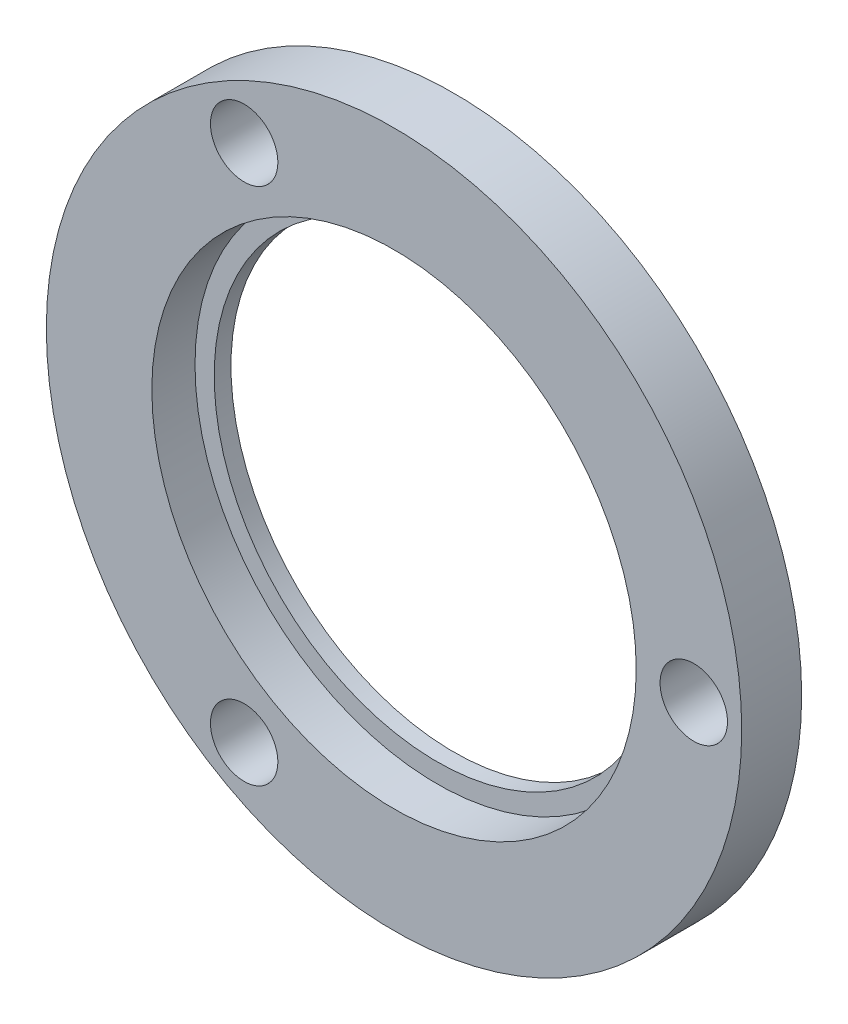
ISO-10303-21;
HEADER;
FILE_DESCRIPTION(('STEP AP214'),'2;1');
FILE_NAME('part.step','',(''),(''),'','','');
FILE_SCHEMA(('AUTOMOTIVE_DESIGN { 1 0 10303 214 1 1 1 1 }'));
ENDSEC;
DATA;
#1=APPLICATION_CONTEXT('core data for automotive mechanical design processes');
#2=APPLICATION_PROTOCOL_DEFINITION('international standard','automotive_design',2000,#1);
#3=PRODUCT_CONTEXT('',#1,'mechanical');
#4=PRODUCT('Part','Part','',(#3));
#5=PRODUCT_RELATED_PRODUCT_CATEGORY('part','',(#4));
#6=PRODUCT_DEFINITION_FORMATION('','',#4);
#7=PRODUCT_DEFINITION_CONTEXT('part definition',#1,'design');
#8=PRODUCT_DEFINITION('design','',#6,#7);
#9=PRODUCT_DEFINITION_SHAPE('','',#8);
#10=(LENGTH_UNIT() NAMED_UNIT(*) SI_UNIT(.MILLI.,.METRE.));
#11=(NAMED_UNIT(*) PLANE_ANGLE_UNIT() SI_UNIT($,.RADIAN.));
#12=(NAMED_UNIT(*) SI_UNIT($,.STERADIAN.) SOLID_ANGLE_UNIT());
#13=UNCERTAINTY_MEASURE_WITH_UNIT(LENGTH_MEASURE(1.E-05),#10,'distance_accuracy_value','');
#14=(GEOMETRIC_REPRESENTATION_CONTEXT(3) GLOBAL_UNCERTAINTY_ASSIGNED_CONTEXT((#13)) GLOBAL_UNIT_ASSIGNED_CONTEXT((#10,
#11,#12)) REPRESENTATION_CONTEXT('',''));
#15=CARTESIAN_POINT('',(0.,0.,0.));
#16=DIRECTION('',(0.,0.,1.));
#17=DIRECTION('',(1.,0.,0.));
#18=AXIS2_PLACEMENT_3D('',#15,#16,#17);
#19=CARTESIAN_POINT('',(0.,0.,-6.35));
#20=DIRECTION('',(0.,0.,1.));
#21=DIRECTION('',(1.,0.,0.));
#22=AXIS2_PLACEMENT_3D('',#19,#20,#21);
#23=CYLINDRICAL_SURFACE('',#22,23.622);
#24=CARTESIAN_POINT('',(0.,0.,-6.35));
#25=DIRECTION('',(0.,0.,1.));
#26=DIRECTION('',(1.,0.,0.));
#27=AXIS2_PLACEMENT_3D('',#24,#25,#26);
#28=CIRCLE('',#27,23.622);
#29=CARTESIAN_POINT('',(23.622,0.,-6.35));
#30=VERTEX_POINT('',#29);
#31=EDGE_CURVE('E61',#30,#30,#28,.T.);
#32=ORIENTED_EDGE('',*,*,#31,.F.);
#33=EDGE_LOOP('',(#32));
#34=FACE_BOUND('',#33,.T.);
#35=CARTESIAN_POINT('',(0.,0.,-4.572));
#36=DIRECTION('',(0.,0.,1.));
#37=DIRECTION('',(1.,0.,0.));
#38=AXIS2_PLACEMENT_3D('',#35,#36,#37);
#39=CIRCLE('',#38,23.622);
#40=CARTESIAN_POINT('',(23.622,0.,-4.572));
#41=VERTEX_POINT('',#40);
#42=EDGE_CURVE('E52',#41,#41,#39,.F.);
#43=ORIENTED_EDGE('',*,*,#42,.F.);
#44=EDGE_LOOP('',(#43));
#45=FACE_BOUND('',#44,.T.);
#46=ADVANCED_FACE('F48',(#34,#45),#23,.F.);
#47=CARTESIAN_POINT('',(0.,0.,-6.35));
#48=DIRECTION('',(0.,0.,1.));
#49=DIRECTION('',(1.,0.,0.));
#50=AXIS2_PLACEMENT_3D('',#47,#48,#49);
#51=CYLINDRICAL_SURFACE('',#50,36.83);
#52=CARTESIAN_POINT('',(0.,0.,-6.35));
#53=DIRECTION('',(0.,0.,1.));
#54=DIRECTION('',(1.,0.,0.));
#55=AXIS2_PLACEMENT_3D('',#52,#53,#54);
#56=CIRCLE('',#55,36.83);
#57=CARTESIAN_POINT('',(36.83,0.,-6.35));
#58=VERTEX_POINT('',#57);
#59=EDGE_CURVE('E13',#58,#58,#56,.T.);
#60=ORIENTED_EDGE('',*,*,#59,.T.);
#61=EDGE_LOOP('',(#60));
#62=FACE_BOUND('',#61,.T.);
#63=CARTESIAN_POINT('',(0.,0.,0.));
#64=DIRECTION('',(0.,0.,1.));
#65=DIRECTION('',(1.,0.,0.));
#66=AXIS2_PLACEMENT_3D('',#63,#64,#65);
#67=CIRCLE('',#66,36.83);
#68=CARTESIAN_POINT('',(36.83,0.,0.));
#69=VERTEX_POINT('',#68);
#70=EDGE_CURVE('E56',#69,#69,#67,.T.);
#71=ORIENTED_EDGE('',*,*,#70,.F.);
#72=EDGE_LOOP('',(#71));
#73=FACE_BOUND('',#72,.T.);
#74=ADVANCED_FACE('F50',(#62,#73),#51,.T.);
#75=CARTESIAN_POINT('',(0.,0.,-6.35));
#76=DIRECTION('',(0.,0.,1.));
#77=DIRECTION('',(1.,0.,0.));
#78=AXIS2_PLACEMENT_3D('',#75,#76,#77);
#79=PLANE('',#78);
#80=CARTESIAN_POINT('',(31.75,0.,-6.35));
#81=DIRECTION('',(0.,0.,1.));
#82=DIRECTION('',(1.,0.,0.));
#83=AXIS2_PLACEMENT_3D('',#80,#81,#82);
#84=CIRCLE('',#83,3.57124);
#85=CARTESIAN_POINT('',(35.32124,0.,-6.35));
#86=VERTEX_POINT('',#85);
#87=EDGE_CURVE('E83',#86,#86,#84,.T.);
#88=ORIENTED_EDGE('',*,*,#87,.T.);
#89=EDGE_LOOP('',(#88));
#90=FACE_BOUND('',#89,.T.);
#91=CARTESIAN_POINT('',(-15.8750000000001,-27.4963065701559,-6.35));
#92=DIRECTION('',(0.,0.,1.));
#93=DIRECTION('',(1.,0.,0.));
#94=AXIS2_PLACEMENT_3D('',#91,#92,#93);
#95=CIRCLE('',#94,3.57124);
#96=CARTESIAN_POINT('',(-12.3037600000001,-27.4963065701559,-6.35));
#97=VERTEX_POINT('',#96);
#98=EDGE_CURVE('E77',#97,#97,#95,.T.);
#99=ORIENTED_EDGE('',*,*,#98,.T.);
#100=EDGE_LOOP('',(#99));
#101=FACE_BOUND('',#100,.T.);
#102=CARTESIAN_POINT('',(-15.8749999999997,27.4963065701561,-6.35));
#103=DIRECTION('',(0.,0.,1.));
#104=DIRECTION('',(1.,0.,0.));
#105=AXIS2_PLACEMENT_3D('',#102,#103,#104);
#106=CIRCLE('',#105,3.57124);
#107=CARTESIAN_POINT('',(-12.3037599999997,27.4963065701561,-6.35));
#108=VERTEX_POINT('',#107);
#109=EDGE_CURVE('E71',#108,#108,#106,.T.);
#110=ORIENTED_EDGE('',*,*,#109,.T.);
#111=EDGE_LOOP('',(#110));
#112=FACE_BOUND('',#111,.T.);
#113=ORIENTED_EDGE('',*,*,#31,.T.);
#114=EDGE_LOOP('',(#113));
#115=FACE_BOUND('',#114,.T.);
#116=ORIENTED_EDGE('',*,*,#59,.F.);
#117=EDGE_LOOP('',(#116));
#118=FACE_BOUND('',#117,.T.);
#119=ADVANCED_FACE('F96',(#90,#101,#112,#115,#118),#79,.F.);
#120=CARTESIAN_POINT('',(0.,0.,0.));
#121=DIRECTION('',(0.,0.,1.));
#122=DIRECTION('',(1.,0.,0.));
#123=AXIS2_PLACEMENT_3D('',#120,#121,#122);
#124=PLANE('',#123);
#125=CARTESIAN_POINT('',(31.75,0.,0.));
#126=DIRECTION('',(0.,0.,1.));
#127=DIRECTION('',(1.,0.,0.));
#128=AXIS2_PLACEMENT_3D('',#125,#126,#127);
#129=CIRCLE('',#128,3.57124);
#130=CARTESIAN_POINT('',(35.32124,0.,0.));
#131=VERTEX_POINT('',#130);
#132=EDGE_CURVE('E86',#131,#131,#129,.T.);
#133=ORIENTED_EDGE('',*,*,#132,.F.);
#134=EDGE_LOOP('',(#133));
#135=FACE_BOUND('',#134,.T.);
#136=CARTESIAN_POINT('',(-15.8750000000001,-27.4963065701559,0.));
#137=DIRECTION('',(0.,0.,1.));
#138=DIRECTION('',(1.,0.,0.));
#139=AXIS2_PLACEMENT_3D('',#136,#137,#138);
#140=CIRCLE('',#139,3.57124);
#141=CARTESIAN_POINT('',(-12.3037600000001,-27.4963065701559,0.));
#142=VERTEX_POINT('',#141);
#143=EDGE_CURVE('E80',#142,#142,#140,.T.);
#144=ORIENTED_EDGE('',*,*,#143,.F.);
#145=EDGE_LOOP('',(#144));
#146=FACE_BOUND('',#145,.T.);
#147=CARTESIAN_POINT('',(-15.8749999999997,27.4963065701561,0.));
#148=DIRECTION('',(0.,0.,1.));
#149=DIRECTION('',(1.,0.,0.));
#150=AXIS2_PLACEMENT_3D('',#147,#148,#149);
#151=CIRCLE('',#150,3.57124);
#152=CARTESIAN_POINT('',(-12.3037599999997,27.4963065701561,0.));
#153=VERTEX_POINT('',#152);
#154=EDGE_CURVE('E74',#153,#153,#151,.T.);
#155=ORIENTED_EDGE('',*,*,#154,.F.);
#156=EDGE_LOOP('',(#155));
#157=FACE_BOUND('',#156,.T.);
#158=CARTESIAN_POINT('',(0.,0.,0.));
#159=DIRECTION('',(0.,0.,1.));
#160=DIRECTION('',(1.,0.,0.));
#161=AXIS2_PLACEMENT_3D('',#158,#159,#160);
#162=CIRCLE('',#161,25.654);
#163=CARTESIAN_POINT('',(25.654,0.,0.));
#164=VERTEX_POINT('',#163);
#165=EDGE_CURVE('E68',#164,#164,#162,.T.);
#166=ORIENTED_EDGE('',*,*,#165,.F.);
#167=EDGE_LOOP('',(#166));
#168=FACE_BOUND('',#167,.T.);
#169=ORIENTED_EDGE('',*,*,#70,.T.);
#170=EDGE_LOOP('',(#169));
#171=FACE_BOUND('',#170,.T.);
#172=ADVANCED_FACE('F92',(#135,#146,#157,#168,#171),#124,.T.);
#173=CARTESIAN_POINT('',(0.,0.,-4.572));
#174=DIRECTION('',(0.,0.,1.));
#175=DIRECTION('',(1.,0.,0.));
#176=AXIS2_PLACEMENT_3D('',#173,#174,#175);
#177=PLANE('',#176);
#178=CARTESIAN_POINT('',(0.,0.,-4.57199999999999));
#179=DIRECTION('',(0.,0.,1.));
#180=DIRECTION('',(1.,0.,0.));
#181=AXIS2_PLACEMENT_3D('',#178,#179,#180);
#182=CIRCLE('',#181,25.654);
#183=CARTESIAN_POINT('',(25.654,0.,-4.57199999999999));
#184=VERTEX_POINT('',#183);
#185=EDGE_CURVE('E65',#184,#184,#182,.F.);
#186=ORIENTED_EDGE('',*,*,#185,.F.);
#187=EDGE_LOOP('',(#186));
#188=FACE_BOUND('',#187,.T.);
#189=ORIENTED_EDGE('',*,*,#42,.T.);
#190=EDGE_LOOP('',(#189));
#191=FACE_BOUND('',#190,.T.);
#192=ADVANCED_FACE('F95',(#188,#191),#177,.T.);
#193=CARTESIAN_POINT('',(0.,0.,-78.9104694582388));
#194=DIRECTION('',(0.,0.,1.));
#195=DIRECTION('',(1.,0.,0.));
#196=AXIS2_PLACEMENT_3D('',#193,#194,#195);
#197=CYLINDRICAL_SURFACE('',#196,25.654);
#198=ORIENTED_EDGE('',*,*,#185,.T.);
#199=EDGE_LOOP('',(#198));
#200=FACE_BOUND('',#199,.T.);
#201=ORIENTED_EDGE('',*,*,#165,.T.);
#202=EDGE_LOOP('',(#201));
#203=FACE_BOUND('',#202,.T.);
#204=ADVANCED_FACE('F119',(#200,#203),#197,.F.);
#205=CARTESIAN_POINT('',(-15.8749999999997,27.4963065701561,0.));
#206=DIRECTION('',(0.,0.,1.));
#207=DIRECTION('',(1.,0.,0.));
#208=AXIS2_PLACEMENT_3D('',#205,#206,#207);
#209=CYLINDRICAL_SURFACE('',#208,3.57124);
#210=ORIENTED_EDGE('',*,*,#109,.F.);
#211=EDGE_LOOP('',(#210));
#212=FACE_BOUND('',#211,.T.);
#213=ORIENTED_EDGE('',*,*,#154,.T.);
#214=EDGE_LOOP('',(#213));
#215=FACE_BOUND('',#214,.T.);
#216=ADVANCED_FACE('F122',(#212,#215),#209,.F.);
#217=CARTESIAN_POINT('',(-15.8750000000001,-27.4963065701559,0.));
#218=DIRECTION('',(0.,0.,1.));
#219=DIRECTION('',(1.,0.,0.));
#220=AXIS2_PLACEMENT_3D('',#217,#218,#219);
#221=CYLINDRICAL_SURFACE('',#220,3.57124);
#222=ORIENTED_EDGE('',*,*,#98,.F.);
#223=EDGE_LOOP('',(#222));
#224=FACE_BOUND('',#223,.T.);
#225=ORIENTED_EDGE('',*,*,#143,.T.);
#226=EDGE_LOOP('',(#225));
#227=FACE_BOUND('',#226,.T.);
#228=ADVANCED_FACE('F129',(#224,#227),#221,.F.);
#229=CARTESIAN_POINT('',(31.75,0.,0.));
#230=DIRECTION('',(0.,0.,1.));
#231=DIRECTION('',(1.,0.,0.));
#232=AXIS2_PLACEMENT_3D('',#229,#230,#231);
#233=CYLINDRICAL_SURFACE('',#232,3.57124);
#234=ORIENTED_EDGE('',*,*,#87,.F.);
#235=EDGE_LOOP('',(#234));
#236=FACE_BOUND('',#235,.T.);
#237=ORIENTED_EDGE('',*,*,#132,.T.);
#238=EDGE_LOOP('',(#237));
#239=FACE_BOUND('',#238,.T.);
#240=ADVANCED_FACE('F90',(#236,#239),#233,.F.);
#241=CLOSED_SHELL('',(#46,#74,#119,#172,#192,#204,#216,#228,#240));
#242=MANIFOLD_SOLID_BREP('B2',#241);
#243=ADVANCED_BREP_SHAPE_REPRESENTATION('',(#18,#242),#14);
#244=SHAPE_DEFINITION_REPRESENTATION(#9,#243);
ENDSEC;
END-ISO-10303-21;
